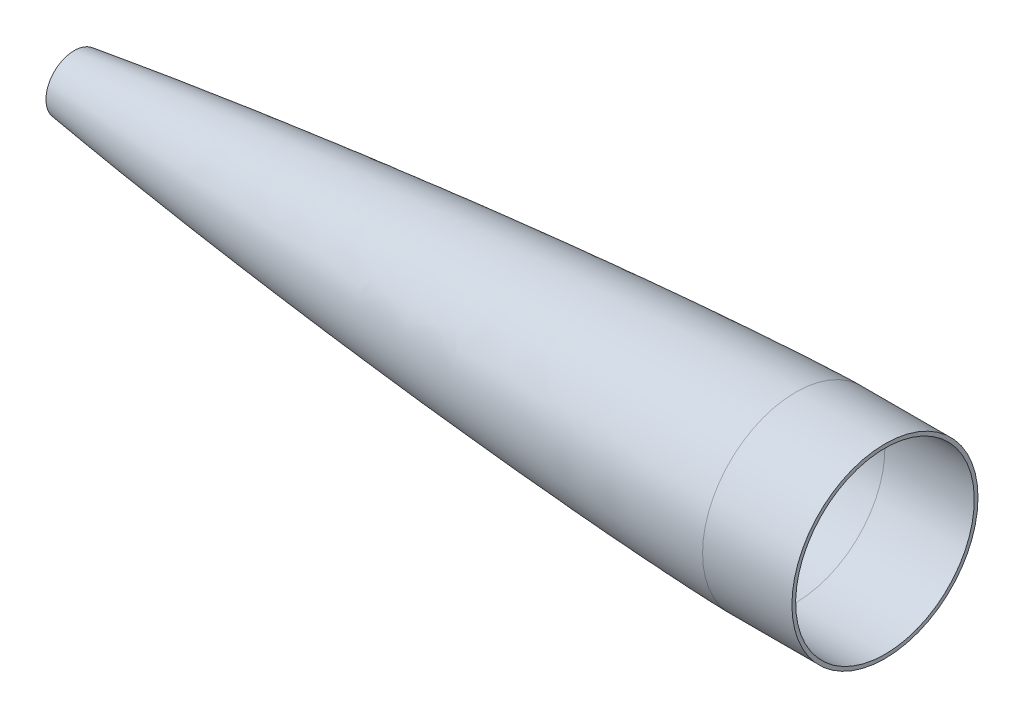
ISO-10303-21;
HEADER;
FILE_DESCRIPTION(('STEP AP214'),'2;1');
FILE_NAME('part.step','',(''),(''),'','','');
FILE_SCHEMA(('AUTOMOTIVE_DESIGN { 1 0 10303 214 1 1 1 1 }'));
ENDSEC;
DATA;
#1=APPLICATION_CONTEXT('core data for automotive mechanical design processes');
#2=APPLICATION_PROTOCOL_DEFINITION('international standard','automotive_design',2000,#1);
#3=PRODUCT_CONTEXT('',#1,'mechanical');
#4=PRODUCT('Part','Part','',(#3));
#5=PRODUCT_RELATED_PRODUCT_CATEGORY('part','',(#4));
#6=PRODUCT_DEFINITION_FORMATION('','',#4);
#7=PRODUCT_DEFINITION_CONTEXT('part definition',#1,'design');
#8=PRODUCT_DEFINITION('design','',#6,#7);
#9=PRODUCT_DEFINITION_SHAPE('','',#8);
#10=(LENGTH_UNIT() NAMED_UNIT(*) SI_UNIT(.MILLI.,.METRE.));
#11=(NAMED_UNIT(*) PLANE_ANGLE_UNIT() SI_UNIT($,.RADIAN.));
#12=(NAMED_UNIT(*) SI_UNIT($,.STERADIAN.) SOLID_ANGLE_UNIT());
#13=UNCERTAINTY_MEASURE_WITH_UNIT(LENGTH_MEASURE(1.E-05),#10,'distance_accuracy_value','');
#14=(GEOMETRIC_REPRESENTATION_CONTEXT(3) GLOBAL_UNCERTAINTY_ASSIGNED_CONTEXT((#13)) GLOBAL_UNIT_ASSIGNED_CONTEXT((#10,
#11,#12)) REPRESENTATION_CONTEXT('',''));
#15=CARTESIAN_POINT('',(0.,0.,0.));
#16=DIRECTION('',(0.,0.,1.));
#17=DIRECTION('',(1.,0.,0.));
#18=AXIS2_PLACEMENT_3D('',#15,#16,#17);
#19=CARTESIAN_POINT('',(762.,79.375,0.));
#20=CARTESIAN_POINT('',(759.374629808439,79.3253193550712,0.));
#21=CARTESIAN_POINT('',(754.124654875215,79.19017212351,0.));
#22=CARTESIAN_POINT('',(743.626304475856,78.8648392707998,0.));
#23=CARTESIAN_POINT('',(726.859894078493,78.2225440985955,0.));
#24=CARTESIAN_POINT('',(706.452486218033,77.3030559295853,0.));
#25=CARTESIAN_POINT('',(676.140102737481,75.7375486752,0.));
#26=CARTESIAN_POINT('',(638.554311162008,73.5095651701059,0.));
#27=CARTESIAN_POINT('',(594.725704038402,70.5693406300502,0.));
#28=CARTESIAN_POINT('',(544.664401623584,66.8095362860275,0.));
#29=CARTESIAN_POINT('',(494.631614208217,62.6883899054903,0.));
#30=CARTESIAN_POINT('',(444.628105480993,58.2264441927354,0.));
#31=CARTESIAN_POINT('',(394.655306894733,53.4327374827959,0.));
#32=CARTESIAN_POINT('',(344.715569587815,48.3061250663313,0.));
#33=CARTESIAN_POINT('',(294.812163926907,42.8365330293953,0.));
#34=CARTESIAN_POINT('',(244.950093832111,37.0019717173394,0.));
#35=CARTESIAN_POINT('',(195.136255167422,30.7674043262595,0.));
#36=CARTESIAN_POINT('',(145.381989514685,24.0732695937921,0.));
#37=CARTESIAN_POINT('',(95.7045452084368,16.8264754891901,0.));
#38=CARTESIAN_POINT('',(53.1300052774773,9.97591936275779,0.));
#39=CARTESIAN_POINT('',(23.0362378126174,4.58820288249183,0.));
#40=CARTESIAN_POINT('',(5.35757112516228,1.09794490591252,0.));
#41=CARTESIAN_POINT('',(-8.20090523268036E-13,-1.55311961208549E-13,0.));
#42=B_SPLINE_CURVE_WITH_KNOTS('',4,(#19,#20,#21,#22,#23,#24,#25,#26,#27,#28,#29,#30,#31,#32,#33,
#34,#35,#36,#37,#38,#39,#40,#41),.UNSPECIFIED.,.F.,.F.,(5,1,1,1,1,1,1,1,1,1,1,1,1,1,1,1,1,1,1,
5),(0.062743102694257,0.0755827162354913,0.0884223297767256,0.114101556859194,0.144785730893954,
0.175469904928713,0.236838253725391,0.29820660103389,0.359574948948792,0.420943297357299,
0.482311645751156,0.543679993157759,0.605048340792134,0.666416688544831,0.727785036276407,
0.789153383790883,0.850521730847485,0.911890077671724,0.973258428583699,1.),.UNSPECIFIED.);
#43=CARTESIAN_POINT('',(0.,0.,0.));
#44=DIRECTION('',(-1.,0.,0.));
#45=AXIS1_PLACEMENT('',#43,#44);
#46=SURFACE_OF_REVOLUTION('',#42,#45);
#47=CARTESIAN_POINT('',(146.625634978142,0.,0.));
#48=DIRECTION('',(1.,0.,0.));
#49=DIRECTION('',(0.,0.,-1.));
#50=AXIS2_PLACEMENT_3D('',#47,#48,#49);
#51=CIRCLE('',#50,24.13);
#52=CARTESIAN_POINT('',(146.625634978142,0.,-24.13));
#53=VERTEX_POINT('',#52);
#54=EDGE_CURVE('E101',#53,#53,#51,.T.);
#55=ORIENTED_EDGE('',*,*,#54,.T.);
#56=EDGE_LOOP('',(#55));
#57=FACE_BOUND('',#56,.T.);
#58=CARTESIAN_POINT('',(762.,0.,0.));
#59=DIRECTION('',(-1.,0.,0.));
#60=DIRECTION('',(0.,-1.,0.));
#61=AXIS2_PLACEMENT_3D('',#58,#59,#60);
#62=CIRCLE('',#61,79.375);
#63=CARTESIAN_POINT('',(762.,-79.375,0.));
#64=VERTEX_POINT('',#63);
#65=EDGE_CURVE('E55',#64,#64,#62,.T.);
#66=ORIENTED_EDGE('',*,*,#65,.T.);
#67=EDGE_LOOP('',(#66));
#68=FACE_BOUND('',#67,.T.);
#69=ADVANCED_FACE('F37',(#57,#68),#46,.T.);
#70=CARTESIAN_POINT('',(146.625634978142,20.574,0.));
#71=CARTESIAN_POINT('',(453.607635717044,56.3920800359111,0.));
#72=CARTESIAN_POINT('',(762.,76.2,0.));
#73=B_SPLINE_CURVE_WITH_KNOTS('',2,(#70,#71,#72),.UNSPECIFIED.,.F.,.F.,(3,3),(0.,1.),.UNSPECIFIED.);
#74=CARTESIAN_POINT('',(0.,0.,0.));
#75=DIRECTION('',(-1.,0.,0.));
#76=AXIS1_PLACEMENT('',#74,#75);
#77=SURFACE_OF_REVOLUTION('',#73,#76);
#78=CARTESIAN_POINT('',(762.,0.,0.));
#79=DIRECTION('',(-1.,0.,0.));
#80=DIRECTION('',(0.,-1.,0.));
#81=AXIS2_PLACEMENT_3D('',#78,#79,#80);
#82=CIRCLE('',#81,76.2);
#83=CARTESIAN_POINT('',(762.,-76.2,0.));
#84=VERTEX_POINT('',#83);
#85=EDGE_CURVE('E10',#84,#84,#82,.T.);
#86=ORIENTED_EDGE('',*,*,#85,.F.);
#87=EDGE_LOOP('',(#86));
#88=FACE_BOUND('',#87,.T.);
#89=CARTESIAN_POINT('',(146.625634978142,0.,0.));
#90=DIRECTION('',(-1.,0.,0.));
#91=DIRECTION('',(0.,-1.,0.));
#92=AXIS2_PLACEMENT_3D('',#89,#90,#91);
#93=CIRCLE('',#92,20.574);
#94=CARTESIAN_POINT('',(146.625634978142,-20.574,0.));
#95=VERTEX_POINT('',#94);
#96=EDGE_CURVE('E61',#95,#95,#93,.T.);
#97=ORIENTED_EDGE('',*,*,#96,.T.);
#98=EDGE_LOOP('',(#97));
#99=FACE_BOUND('',#98,.T.);
#100=ADVANCED_FACE('F72',(#88,#99),#77,.T.);
#101=CARTESIAN_POINT('',(0.,0.,0.));
#102=DIRECTION('',(-1.,0.,0.));
#103=DIRECTION('',(0.,-1.,0.));
#104=AXIS2_PLACEMENT_3D('',#101,#102,#103);
#105=CYLINDRICAL_SURFACE('',#104,76.2);
#106=CARTESIAN_POINT('',(838.2,0.,0.));
#107=DIRECTION('',(-1.,0.,0.));
#108=DIRECTION('',(0.,-1.,0.));
#109=AXIS2_PLACEMENT_3D('',#106,#107,#108);
#110=CIRCLE('',#109,76.2);
#111=CARTESIAN_POINT('',(838.2,-76.2,0.));
#112=VERTEX_POINT('',#111);
#113=EDGE_CURVE('E45',#112,#112,#110,.T.);
#114=ORIENTED_EDGE('',*,*,#113,.F.);
#115=EDGE_LOOP('',(#114));
#116=FACE_BOUND('',#115,.T.);
#117=ORIENTED_EDGE('',*,*,#85,.T.);
#118=EDGE_LOOP('',(#117));
#119=FACE_BOUND('',#118,.T.);
#120=ADVANCED_FACE('F75',(#116,#119),#105,.F.);
#121=CARTESIAN_POINT('',(838.2,79.375,0.));
#122=DIRECTION('',(-1.,0.,0.));
#123=DIRECTION('',(0.,-1.,0.));
#124=AXIS2_PLACEMENT_3D('',#121,#122,#123);
#125=PLANE('',#124);
#126=CARTESIAN_POINT('',(838.2,0.,0.));
#127=DIRECTION('',(-1.,0.,0.));
#128=DIRECTION('',(0.,-1.,0.));
#129=AXIS2_PLACEMENT_3D('',#126,#127,#128);
#130=CIRCLE('',#129,79.375);
#131=CARTESIAN_POINT('',(838.2,-79.375,0.));
#132=VERTEX_POINT('',#131);
#133=EDGE_CURVE('E50',#132,#132,#130,.T.);
#134=ORIENTED_EDGE('',*,*,#133,.F.);
#135=EDGE_LOOP('',(#134));
#136=FACE_BOUND('',#135,.T.);
#137=ORIENTED_EDGE('',*,*,#113,.T.);
#138=EDGE_LOOP('',(#137));
#139=FACE_BOUND('',#138,.T.);
#140=ADVANCED_FACE('F79',(#136,#139),#125,.F.);
#141=CARTESIAN_POINT('',(0.,0.,0.));
#142=DIRECTION('',(-1.,0.,0.));
#143=DIRECTION('',(0.,-1.,0.));
#144=AXIS2_PLACEMENT_3D('',#141,#142,#143);
#145=CYLINDRICAL_SURFACE('',#144,79.375);
#146=ORIENTED_EDGE('',*,*,#65,.F.);
#147=EDGE_LOOP('',(#146));
#148=FACE_BOUND('',#147,.T.);
#149=ORIENTED_EDGE('',*,*,#133,.T.);
#150=EDGE_LOOP('',(#149));
#151=FACE_BOUND('',#150,.T.);
#152=ADVANCED_FACE('F83',(#148,#151),#145,.T.);
#153=CARTESIAN_POINT('',(146.625634978142,0.,0.));
#154=DIRECTION('',(1.,0.,0.));
#155=DIRECTION('',(0.,0.,-1.));
#156=AXIS2_PLACEMENT_3D('',#153,#154,#155);
#157=PLANE('',#156);
#158=ORIENTED_EDGE('',*,*,#54,.F.);
#159=EDGE_LOOP('',(#158));
#160=FACE_BOUND('',#159,.T.);
#161=ORIENTED_EDGE('',*,*,#96,.F.);
#162=EDGE_LOOP('',(#161));
#163=FACE_BOUND('',#162,.T.);
#164=ADVANCED_FACE('F87',(#160,#163),#157,.F.);
#165=CLOSED_SHELL('',(#69,#100,#120,#140,#152,#164));
#166=MANIFOLD_SOLID_BREP('B2',#165);
#167=ADVANCED_BREP_SHAPE_REPRESENTATION('',(#18,#166),#14);
#168=SHAPE_DEFINITION_REPRESENTATION(#9,#167);
ENDSEC;
END-ISO-10303-21;
